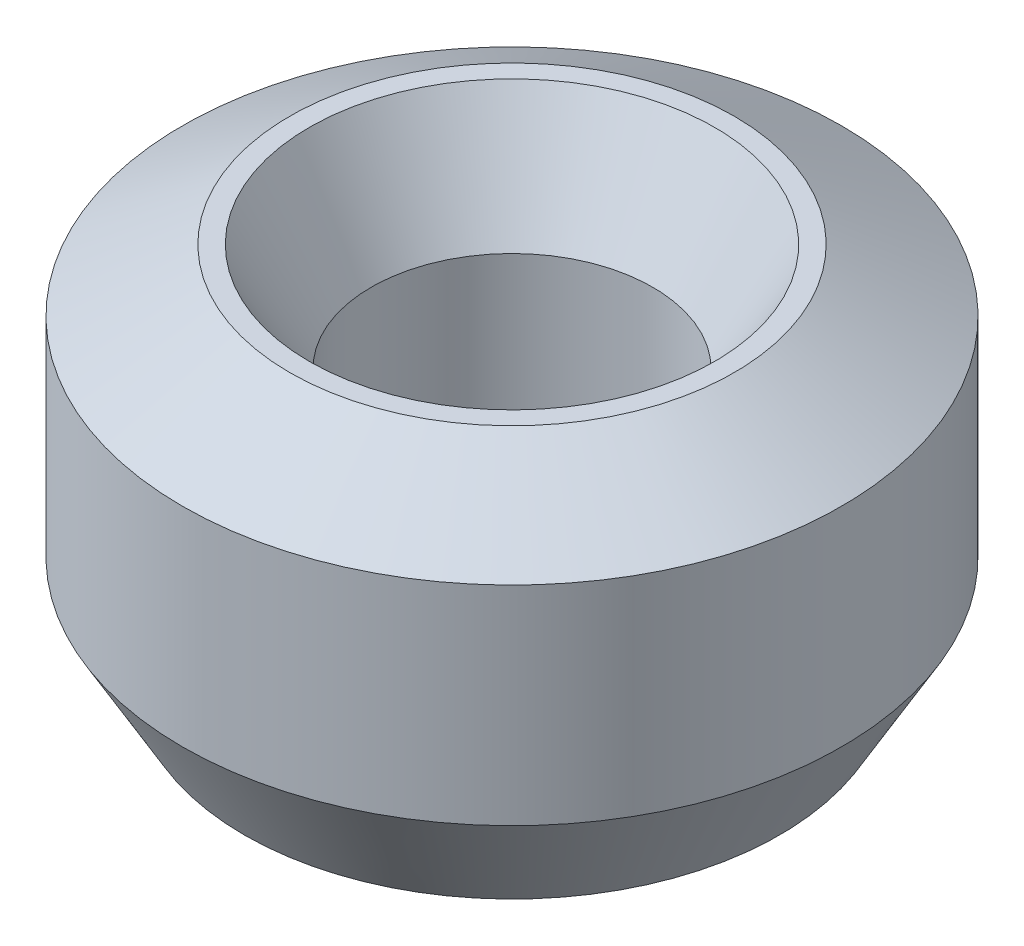
ISO-10303-21;
HEADER;
FILE_DESCRIPTION(('STEP AP214'),'2;1');
FILE_NAME('part.step','',(''),(''),'','','');
FILE_SCHEMA(('AUTOMOTIVE_DESIGN { 1 0 10303 214 1 1 1 1 }'));
ENDSEC;
DATA;
#1=APPLICATION_CONTEXT('core data for automotive mechanical design processes');
#2=APPLICATION_PROTOCOL_DEFINITION('international standard','automotive_design',2000,#1);
#3=PRODUCT_CONTEXT('',#1,'mechanical');
#4=PRODUCT('Part','Part','',(#3));
#5=PRODUCT_RELATED_PRODUCT_CATEGORY('part','',(#4));
#6=PRODUCT_DEFINITION_FORMATION('','',#4);
#7=PRODUCT_DEFINITION_CONTEXT('part definition',#1,'design');
#8=PRODUCT_DEFINITION('design','',#6,#7);
#9=PRODUCT_DEFINITION_SHAPE('','',#8);
#10=(LENGTH_UNIT() NAMED_UNIT(*) SI_UNIT(.MILLI.,.METRE.));
#11=(NAMED_UNIT(*) PLANE_ANGLE_UNIT() SI_UNIT($,.RADIAN.));
#12=(NAMED_UNIT(*) SI_UNIT($,.STERADIAN.) SOLID_ANGLE_UNIT());
#13=UNCERTAINTY_MEASURE_WITH_UNIT(LENGTH_MEASURE(1.E-05),#10,'distance_accuracy_value','');
#14=(GEOMETRIC_REPRESENTATION_CONTEXT(3) GLOBAL_UNCERTAINTY_ASSIGNED_CONTEXT((#13)) GLOBAL_UNIT_ASSIGNED_CONTEXT((#10,
#11,#12)) REPRESENTATION_CONTEXT('',''));
#15=CARTESIAN_POINT('',(0.,0.,0.));
#16=DIRECTION('',(0.,0.,1.));
#17=DIRECTION('',(1.,0.,0.));
#18=AXIS2_PLACEMENT_3D('',#15,#16,#17);
#19=CARTESIAN_POINT('',(0.,8.59787890711244,0.));
#20=DIRECTION('',(0.,-1.,0.));
#21=DIRECTION('',(0.,0.,-1.));
#22=AXIS2_PLACEMENT_3D('',#19,#20,#21);
#23=CYLINDRICAL_SURFACE('',#22,7.5);
#24=CARTESIAN_POINT('',(0.,2.44397814591814,0.));
#25=DIRECTION('',(0.,1.,0.));
#26=DIRECTION('',(0.,0.,1.));
#27=AXIS2_PLACEMENT_3D('',#24,#25,#26);
#28=CIRCLE('',#27,7.5);
#29=CARTESIAN_POINT('',(0.,2.44397814591814,7.5));
#30=VERTEX_POINT('',#29);
#31=EDGE_CURVE('E10',#30,#30,#28,.T.);
#32=ORIENTED_EDGE('',*,*,#31,.T.);
#33=EDGE_LOOP('',(#32));
#34=FACE_BOUND('',#33,.T.);
#35=CARTESIAN_POINT('',(0.,7.18684746667303,0.));
#36=DIRECTION('',(0.,1.,0.));
#37=DIRECTION('',(0.,0.,1.));
#38=AXIS2_PLACEMENT_3D('',#35,#36,#37);
#39=CIRCLE('',#38,7.5);
#40=CARTESIAN_POINT('',(0.,7.18684746667303,7.5));
#41=VERTEX_POINT('',#40);
#42=EDGE_CURVE('E50',#41,#41,#39,.F.);
#43=ORIENTED_EDGE('',*,*,#42,.T.);
#44=EDGE_LOOP('',(#43));
#45=FACE_BOUND('',#44,.T.);
#46=ADVANCED_FACE('F39',(#34,#45),#23,.T.);
#47=CARTESIAN_POINT('',(0.,8.59787890711244,0.));
#48=DIRECTION('',(0.,1.,0.));
#49=DIRECTION('',(0.,0.,1.));
#50=AXIS2_PLACEMENT_3D('',#47,#48,#49);
#51=PLANE('',#50);
#52=CARTESIAN_POINT('',(0.,8.59787890711244,0.));
#53=DIRECTION('',(0.,1.,0.));
#54=DIRECTION('',(0.,0.,1.));
#55=AXIS2_PLACEMENT_3D('',#52,#53,#54);
#56=CIRCLE('',#55,4.61384506245303);
#57=CARTESIAN_POINT('',(0.,8.59787890711244,4.61384506245303));
#58=VERTEX_POINT('',#57);
#59=EDGE_CURVE('E58',#58,#58,#56,.F.);
#60=ORIENTED_EDGE('',*,*,#59,.T.);
#61=EDGE_LOOP('',(#60));
#62=FACE_BOUND('',#61,.T.);
#63=CARTESIAN_POINT('',(0.,8.59787890711244,0.));
#64=DIRECTION('',(0.,1.,0.));
#65=DIRECTION('',(0.,0.,1.));
#66=AXIS2_PLACEMENT_3D('',#63,#64,#65);
#67=CIRCLE('',#66,5.05602185408186);
#68=CARTESIAN_POINT('',(0.,8.59787890711244,5.05602185408186));
#69=VERTEX_POINT('',#68);
#70=EDGE_CURVE('E61',#69,#69,#67,.T.);
#71=ORIENTED_EDGE('',*,*,#70,.T.);
#72=EDGE_LOOP('',(#71));
#73=FACE_BOUND('',#72,.T.);
#74=ADVANCED_FACE('F88',(#62,#73),#51,.T.);
#75=CARTESIAN_POINT('',(0.,0.,0.));
#76=DIRECTION('',(0.,1.,0.));
#77=DIRECTION('',(0.,0.,1.));
#78=AXIS2_PLACEMENT_3D('',#75,#76,#77);
#79=PLANE('',#78);
#80=CARTESIAN_POINT('',(0.,0.,0.));
#81=DIRECTION('',(0.,1.,0.));
#82=DIRECTION('',(0.,0.,1.));
#83=AXIS2_PLACEMENT_3D('',#80,#81,#82);
#84=CIRCLE('',#83,5.64679176793175);
#85=CARTESIAN_POINT('',(0.,0.,5.64679176793175));
#86=VERTEX_POINT('',#85);
#87=EDGE_CURVE('E51',#86,#86,#84,.T.);
#88=ORIENTED_EDGE('',*,*,#87,.T.);
#89=EDGE_LOOP('',(#88));
#90=FACE_BOUND('',#89,.T.);
#91=CARTESIAN_POINT('',(0.,0.,0.));
#92=DIRECTION('',(0.,1.,0.));
#93=DIRECTION('',(0.,0.,1.));
#94=AXIS2_PLACEMENT_3D('',#91,#92,#93);
#95=CIRCLE('',#94,6.08896855956059);
#96=CARTESIAN_POINT('',(0.,0.,6.08896855956059));
#97=VERTEX_POINT('',#96);
#98=EDGE_CURVE('E54',#97,#97,#95,.F.);
#99=ORIENTED_EDGE('',*,*,#98,.T.);
#100=EDGE_LOOP('',(#99));
#101=FACE_BOUND('',#100,.T.);
#102=ADVANCED_FACE('F83',(#90,#101),#79,.F.);
#103=CARTESIAN_POINT('',(0.,8.59787890711244,0.));
#104=DIRECTION('',(0.,-1.,0.));
#105=DIRECTION('',(0.,0.,-1.));
#106=AXIS2_PLACEMENT_3D('',#103,#104,#105);
#107=CYLINDRICAL_SURFACE('',#106,3.20281362201361);
#108=CARTESIAN_POINT('',(0.,6.1539007611943,0.));
#109=DIRECTION('',(0.,1.,0.));
#110=DIRECTION('',(0.,0.,1.));
#111=AXIS2_PLACEMENT_3D('',#108,#109,#110);
#112=CIRCLE('',#111,3.20281362201361);
#113=CARTESIAN_POINT('',(0.,6.1539007611943,3.20281362201361));
#114=VERTEX_POINT('',#113);
#115=EDGE_CURVE('E67',#114,#114,#112,.T.);
#116=ORIENTED_EDGE('',*,*,#115,.T.);
#117=EDGE_LOOP('',(#116));
#118=FACE_BOUND('',#117,.T.);
#119=CARTESIAN_POINT('',(0.,1.41103144043941,0.));
#120=DIRECTION('',(0.,1.,0.));
#121=DIRECTION('',(0.,0.,1.));
#122=AXIS2_PLACEMENT_3D('',#119,#120,#121);
#123=CIRCLE('',#122,3.20281362201361);
#124=CARTESIAN_POINT('',(0.,1.41103144043941,3.20281362201361));
#125=VERTEX_POINT('',#124);
#126=EDGE_CURVE('E69',#125,#125,#123,.F.);
#127=ORIENTED_EDGE('',*,*,#126,.T.);
#128=EDGE_LOOP('',(#127));
#129=FACE_BOUND('',#128,.T.);
#130=ADVANCED_FACE('F71',(#118,#129),#107,.F.);
#131=CARTESIAN_POINT('',(0.,6.1539007611943,0.));
#132=DIRECTION('',(0.,1.,0.));
#133=DIRECTION('',(0.,0.,1.));
#134=AXIS2_PLACEMENT_3D('',#131,#132,#133);
#135=CONICAL_SURFACE('',#134,3.20281362201361,0.523598775598303);
#136=ORIENTED_EDGE('',*,*,#59,.F.);
#137=EDGE_LOOP('',(#136));
#138=FACE_BOUND('',#137,.T.);
#139=ORIENTED_EDGE('',*,*,#115,.F.);
#140=EDGE_LOOP('',(#139));
#141=FACE_BOUND('',#140,.T.);
#142=ADVANCED_FACE('F77',(#138,#141),#135,.F.);
#143=CARTESIAN_POINT('',(0.,0.,0.));
#144=DIRECTION('',(0.,-1.,0.));
#145=DIRECTION('',(0.,0.,-1.));
#146=AXIS2_PLACEMENT_3D('',#143,#144,#145);
#147=CONICAL_SURFACE('',#146,5.64679176793175,1.04719755119659);
#148=ORIENTED_EDGE('',*,*,#126,.F.);
#149=EDGE_LOOP('',(#148));
#150=FACE_BOUND('',#149,.T.);
#151=ORIENTED_EDGE('',*,*,#87,.F.);
#152=EDGE_LOOP('',(#151));
#153=FACE_BOUND('',#152,.T.);
#154=ADVANCED_FACE('F73',(#150,#153),#147,.F.);
#155=CARTESIAN_POINT('',(0.,2.44397814591814,0.));
#156=DIRECTION('',(0.,1.,0.));
#157=DIRECTION('',(0.,0.,1.));
#158=AXIS2_PLACEMENT_3D('',#155,#156,#157);
#159=CONICAL_SURFACE('',#158,7.5,0.523598775598302);
#160=ORIENTED_EDGE('',*,*,#98,.F.);
#161=EDGE_LOOP('',(#160));
#162=FACE_BOUND('',#161,.T.);
#163=ORIENTED_EDGE('',*,*,#31,.F.);
#164=EDGE_LOOP('',(#163));
#165=FACE_BOUND('',#164,.T.);
#166=ADVANCED_FACE('F76',(#162,#165),#159,.T.);
#167=CARTESIAN_POINT('',(0.,8.59787890711244,0.));
#168=DIRECTION('',(0.,-1.,0.));
#169=DIRECTION('',(0.,0.,-1.));
#170=AXIS2_PLACEMENT_3D('',#167,#168,#169);
#171=CONICAL_SURFACE('',#170,5.05602185408186,1.04719755119659);
#172=ORIENTED_EDGE('',*,*,#42,.F.);
#173=EDGE_LOOP('',(#172));
#174=FACE_BOUND('',#173,.T.);
#175=ORIENTED_EDGE('',*,*,#70,.F.);
#176=EDGE_LOOP('',(#175));
#177=FACE_BOUND('',#176,.T.);
#178=ADVANCED_FACE('F45',(#174,#177),#171,.T.);
#179=CLOSED_SHELL('',(#46,#74,#102,#130,#142,#154,#166,#178));
#180=MANIFOLD_SOLID_BREP('B2',#179);
#181=ADVANCED_BREP_SHAPE_REPRESENTATION('',(#18,#180),#14);
#182=SHAPE_DEFINITION_REPRESENTATION(#9,#181);
ENDSEC;
END-ISO-10303-21;
